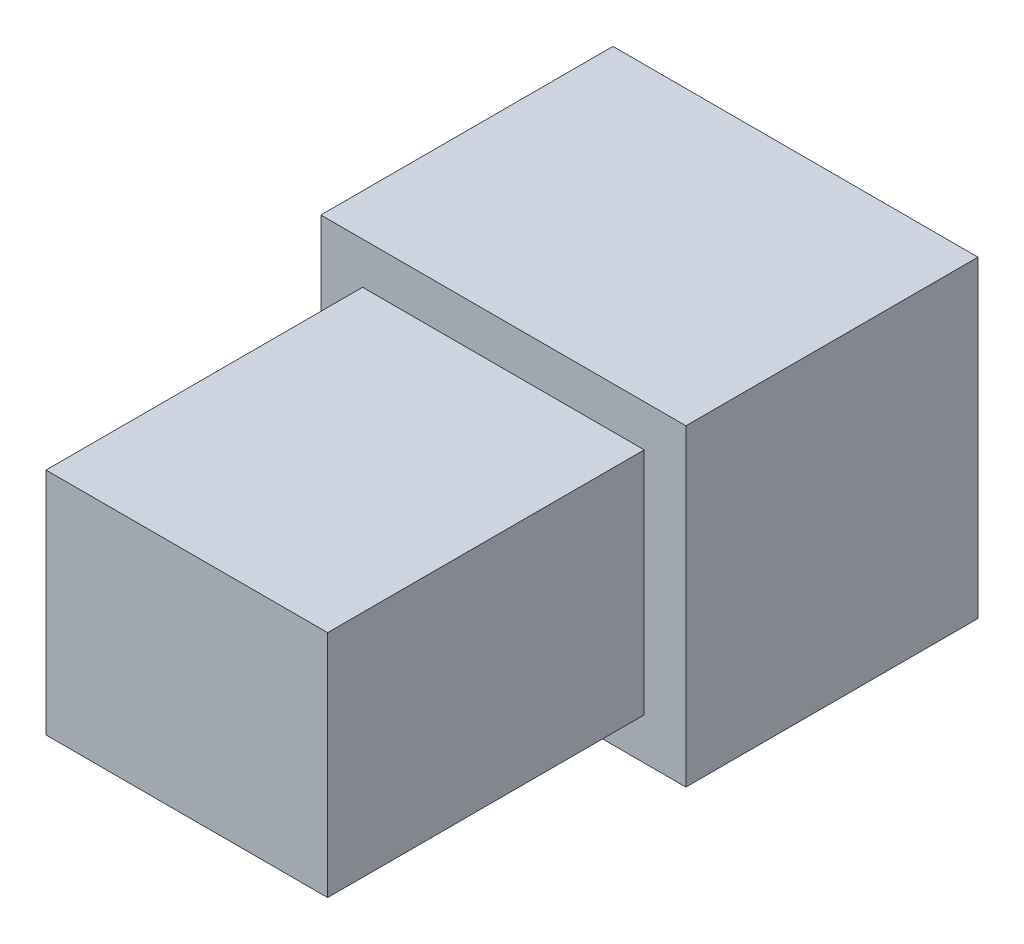
ISO-10303-21;
HEADER;
FILE_DESCRIPTION(('STEP AP214'),'2;1');
FILE_NAME('part.step','',(''),(''),'','','');
FILE_SCHEMA(('AUTOMOTIVE_DESIGN { 1 0 10303 214 1 1 1 1 }'));
ENDSEC;
DATA;
#1=APPLICATION_CONTEXT('core data for automotive mechanical design processes');
#2=APPLICATION_PROTOCOL_DEFINITION('international standard','automotive_design',2000,#1);
#3=PRODUCT_CONTEXT('',#1,'mechanical');
#4=PRODUCT('Part','Part','',(#3));
#5=PRODUCT_RELATED_PRODUCT_CATEGORY('part','',(#4));
#6=PRODUCT_DEFINITION_FORMATION('','',#4);
#7=PRODUCT_DEFINITION_CONTEXT('part definition',#1,'design');
#8=PRODUCT_DEFINITION('design','',#6,#7);
#9=PRODUCT_DEFINITION_SHAPE('','',#8);
#10=(LENGTH_UNIT() NAMED_UNIT(*) SI_UNIT(.MILLI.,.METRE.));
#11=(NAMED_UNIT(*) PLANE_ANGLE_UNIT() SI_UNIT($,.RADIAN.));
#12=(NAMED_UNIT(*) SI_UNIT($,.STERADIAN.) SOLID_ANGLE_UNIT());
#13=UNCERTAINTY_MEASURE_WITH_UNIT(LENGTH_MEASURE(1.E-05),#10,'distance_accuracy_value','');
#14=(GEOMETRIC_REPRESENTATION_CONTEXT(3) GLOBAL_UNCERTAINTY_ASSIGNED_CONTEXT((#13)) GLOBAL_UNIT_ASSIGNED_CONTEXT((#10,
#11,#12)) REPRESENTATION_CONTEXT('',''));
#15=CARTESIAN_POINT('',(0.,0.,0.));
#16=DIRECTION('',(0.,0.,1.));
#17=DIRECTION('',(1.,0.,0.));
#18=AXIS2_PLACEMENT_3D('',#15,#16,#17);
#19=CARTESIAN_POINT('',(4124.,1250.,2800.));
#20=DIRECTION('',(0.,0.,-1.));
#21=DIRECTION('',(-1.,0.,0.));
#22=AXIS2_PLACEMENT_3D('',#19,#20,#21);
#23=PLANE('',#22);
#24=DIRECTION('',(0.,-1.,0.));
#25=VECTOR('',#24,1.);
#26=CARTESIAN_POINT('',(4124.,-1750.,2800.));
#27=LINE('',#26,#25);
#28=CARTESIAN_POINT('',(4124.,1250.,2800.));
#29=VERTEX_POINT('',#28);
#30=CARTESIAN_POINT('',(4124.,-1750.,2800.));
#31=VERTEX_POINT('',#30);
#32=EDGE_CURVE('E125',#29,#31,#27,.T.);
#33=ORIENTED_EDGE('',*,*,#32,.T.);
#34=DIRECTION('',(1.,0.,0.));
#35=VECTOR('',#34,1.);
#36=CARTESIAN_POINT('',(4124.,-1750.,2800.));
#37=LINE('',#36,#35);
#38=CARTESIAN_POINT('',(7624.,-1750.,2800.));
#39=VERTEX_POINT('',#38);
#40=EDGE_CURVE('E128',#31,#39,#37,.T.);
#41=ORIENTED_EDGE('',*,*,#40,.T.);
#42=DIRECTION('',(0.,1.,0.));
#43=VECTOR('',#42,1.);
#44=CARTESIAN_POINT('',(7624.,-1750.,2800.));
#45=LINE('',#44,#43);
#46=CARTESIAN_POINT('',(7624.,1250.,2800.));
#47=VERTEX_POINT('',#46);
#48=EDGE_CURVE('E131',#39,#47,#45,.T.);
#49=ORIENTED_EDGE('',*,*,#48,.T.);
#50=DIRECTION('',(-1.,0.,0.));
#51=VECTOR('',#50,1.);
#52=CARTESIAN_POINT('',(4124.,1250.,2800.));
#53=LINE('',#52,#51);
#54=EDGE_CURVE('E133',#47,#29,#53,.T.);
#55=ORIENTED_EDGE('',*,*,#54,.T.);
#56=EDGE_LOOP('',(#33,#41,#49,#55));
#57=FACE_BOUND('',#56,.T.);
#58=DIRECTION('',(-1.,0.,0.));
#59=VECTOR('',#58,1.);
#60=CARTESIAN_POINT('',(7224.,850.000000000002,2800.));
#61=LINE('',#60,#59);
#62=CARTESIAN_POINT('',(7224.,850.000000000002,2800.));
#63=VERTEX_POINT('',#62);
#64=CARTESIAN_POINT('',(4524.,850.000000000002,2800.));
#65=VERTEX_POINT('',#64);
#66=EDGE_CURVE('E115',#63,#65,#61,.T.);
#67=ORIENTED_EDGE('',*,*,#66,.F.);
#68=DIRECTION('',(0.,1.,0.));
#69=VECTOR('',#68,1.);
#70=CARTESIAN_POINT('',(7224.,-1350.,2800.));
#71=LINE('',#70,#69);
#72=CARTESIAN_POINT('',(7224.,-1350.,2800.));
#73=VERTEX_POINT('',#72);
#74=EDGE_CURVE('E112',#73,#63,#71,.T.);
#75=ORIENTED_EDGE('',*,*,#74,.F.);
#76=DIRECTION('',(1.,0.,0.));
#77=VECTOR('',#76,1.);
#78=CARTESIAN_POINT('',(4524.,-1350.,2800.));
#79=LINE('',#78,#77);
#80=CARTESIAN_POINT('',(4524.,-1350.,2800.));
#81=VERTEX_POINT('',#80);
#82=EDGE_CURVE('E50',#81,#73,#79,.T.);
#83=ORIENTED_EDGE('',*,*,#82,.F.);
#84=DIRECTION('',(0.,-1.,0.));
#85=VECTOR('',#84,1.);
#86=CARTESIAN_POINT('',(4524.,850.000000000002,2800.));
#87=LINE('',#86,#85);
#88=EDGE_CURVE('E45',#65,#81,#87,.T.);
#89=ORIENTED_EDGE('',*,*,#88,.F.);
#90=EDGE_LOOP('',(#67,#75,#83,#89));
#91=FACE_BOUND('',#90,.T.);
#92=ADVANCED_FACE('F30',(#57,#91),#23,.F.);
#93=CARTESIAN_POINT('',(4124.,-1750.,2800.));
#94=DIRECTION('',(1.,0.,0.));
#95=DIRECTION('',(0.,1.,0.));
#96=AXIS2_PLACEMENT_3D('',#93,#94,#95);
#97=PLANE('',#96);
#98=DIRECTION('',(0.,-1.,0.));
#99=VECTOR('',#98,1.);
#100=CARTESIAN_POINT('',(4124.,-1750.,-1.16573417585641E-12));
#101=LINE('',#100,#99);
#102=CARTESIAN_POINT('',(4124.,1250.,8.11850586757146E-13));
#103=VERTEX_POINT('',#102);
#104=CARTESIAN_POINT('',(4124.,-1750.,-1.16573417585641E-12));
#105=VERTEX_POINT('',#104);
#106=EDGE_CURVE('E116',#103,#105,#101,.T.);
#107=ORIENTED_EDGE('',*,*,#106,.T.);
#108=DIRECTION('',(0.,0.,-1.));
#109=VECTOR('',#108,1.);
#110=CARTESIAN_POINT('',(4124.,-1750.,2800.));
#111=LINE('',#110,#109);
#112=EDGE_CURVE('E11',#31,#105,#111,.T.);
#113=ORIENTED_EDGE('',*,*,#112,.F.);
#114=ORIENTED_EDGE('',*,*,#32,.F.);
#115=DIRECTION('',(0.,0.,-1.));
#116=VECTOR('',#115,1.);
#117=CARTESIAN_POINT('',(4124.,1250.,2800.));
#118=LINE('',#117,#116);
#119=EDGE_CURVE('E134',#29,#103,#118,.T.);
#120=ORIENTED_EDGE('',*,*,#119,.T.);
#121=EDGE_LOOP('',(#107,#113,#114,#120));
#122=FACE_BOUND('',#121,.T.);
#123=ADVANCED_FACE('F32',(#122),#97,.F.);
#124=CARTESIAN_POINT('',(4124.,-1750.,2800.));
#125=DIRECTION('',(0.,1.,0.));
#126=DIRECTION('',(0.,0.,1.));
#127=AXIS2_PLACEMENT_3D('',#124,#125,#126);
#128=PLANE('',#127);
#129=DIRECTION('',(1.,0.,0.));
#130=VECTOR('',#129,1.);
#131=CARTESIAN_POINT('',(4124.,-1750.,-1.16573417585641E-12));
#132=LINE('',#131,#130);
#133=CARTESIAN_POINT('',(7624.,-1750.,-1.16573417585641E-12));
#134=VERTEX_POINT('',#133);
#135=EDGE_CURVE('E119',#105,#134,#132,.T.);
#136=ORIENTED_EDGE('',*,*,#135,.T.);
#137=DIRECTION('',(0.,0.,-1.));
#138=VECTOR('',#137,1.);
#139=CARTESIAN_POINT('',(7624.,-1750.,2800.));
#140=LINE('',#139,#138);
#141=EDGE_CURVE('E38',#39,#134,#140,.T.);
#142=ORIENTED_EDGE('',*,*,#141,.F.);
#143=ORIENTED_EDGE('',*,*,#40,.F.);
#144=ORIENTED_EDGE('',*,*,#112,.T.);
#145=EDGE_LOOP('',(#136,#142,#143,#144));
#146=FACE_BOUND('',#145,.T.);
#147=ADVANCED_FACE('F164',(#146),#128,.F.);
#148=CARTESIAN_POINT('',(7624.,-1750.,2800.));
#149=DIRECTION('',(-1.,0.,0.));
#150=DIRECTION('',(0.,0.,1.));
#151=AXIS2_PLACEMENT_3D('',#148,#149,#150);
#152=PLANE('',#151);
#153=DIRECTION('',(0.,1.,0.));
#154=VECTOR('',#153,1.);
#155=CARTESIAN_POINT('',(7624.,-1750.,-1.16573417585641E-12));
#156=LINE('',#155,#154);
#157=CARTESIAN_POINT('',(7624.,1250.,8.11850586757146E-13));
#158=VERTEX_POINT('',#157);
#159=EDGE_CURVE('E137',#134,#158,#156,.T.);
#160=ORIENTED_EDGE('',*,*,#159,.T.);
#161=DIRECTION('',(0.,0.,-1.));
#162=VECTOR('',#161,1.);
#163=CARTESIAN_POINT('',(7624.,1250.,2800.));
#164=LINE('',#163,#162);
#165=EDGE_CURVE('E142',#47,#158,#164,.T.);
#166=ORIENTED_EDGE('',*,*,#165,.F.);
#167=ORIENTED_EDGE('',*,*,#48,.F.);
#168=ORIENTED_EDGE('',*,*,#141,.T.);
#169=EDGE_LOOP('',(#160,#166,#167,#168));
#170=FACE_BOUND('',#169,.T.);
#171=ADVANCED_FACE('F149',(#170),#152,.F.);
#172=CARTESIAN_POINT('',(4124.,1250.,2800.));
#173=DIRECTION('',(0.,-1.,0.));
#174=DIRECTION('',(0.,0.,-1.));
#175=AXIS2_PLACEMENT_3D('',#172,#173,#174);
#176=PLANE('',#175);
#177=DIRECTION('',(-1.,0.,0.));
#178=VECTOR('',#177,1.);
#179=CARTESIAN_POINT('',(4124.,1250.,8.11850586757146E-13));
#180=LINE('',#179,#178);
#181=EDGE_CURVE('E129',#158,#103,#180,.T.);
#182=ORIENTED_EDGE('',*,*,#181,.T.);
#183=ORIENTED_EDGE('',*,*,#119,.F.);
#184=ORIENTED_EDGE('',*,*,#54,.F.);
#185=ORIENTED_EDGE('',*,*,#165,.T.);
#186=EDGE_LOOP('',(#182,#183,#184,#185));
#187=FACE_BOUND('',#186,.T.);
#188=ADVANCED_FACE('F158',(#187),#176,.F.);
#189=CARTESIAN_POINT('',(4124.,1250.,8.11850586757146E-13));
#190=DIRECTION('',(0.,0.,-1.));
#191=DIRECTION('',(-1.,0.,0.));
#192=AXIS2_PLACEMENT_3D('',#189,#190,#191);
#193=PLANE('',#192);
#194=ORIENTED_EDGE('',*,*,#106,.F.);
#195=ORIENTED_EDGE('',*,*,#181,.F.);
#196=ORIENTED_EDGE('',*,*,#159,.F.);
#197=ORIENTED_EDGE('',*,*,#135,.F.);
#198=EDGE_LOOP('',(#194,#195,#196,#197));
#199=FACE_BOUND('',#198,.T.);
#200=ADVANCED_FACE('F155',(#199),#193,.T.);
#201=CARTESIAN_POINT('',(7224.,850.000000000004,5835.));
#202=DIRECTION('',(0.,-1.,0.));
#203=DIRECTION('',(0.,0.,-1.));
#204=AXIS2_PLACEMENT_3D('',#201,#202,#203);
#205=PLANE('',#204);
#206=ORIENTED_EDGE('',*,*,#66,.T.);
#207=DIRECTION('',(0.,0.,-1.));
#208=VECTOR('',#207,1.);
#209=CARTESIAN_POINT('',(4524.,850.000000000004,5835.));
#210=LINE('',#209,#208);
#211=CARTESIAN_POINT('',(4524.,850.000000000004,5835.));
#212=VERTEX_POINT('',#211);
#213=EDGE_CURVE('E96',#212,#65,#210,.T.);
#214=ORIENTED_EDGE('',*,*,#213,.F.);
#215=DIRECTION('',(-1.,0.,0.));
#216=VECTOR('',#215,1.);
#217=CARTESIAN_POINT('',(7224.,850.000000000004,5835.));
#218=LINE('',#217,#216);
#219=CARTESIAN_POINT('',(7224.,850.000000000004,5835.));
#220=VERTEX_POINT('',#219);
#221=EDGE_CURVE('E103',#220,#212,#218,.T.);
#222=ORIENTED_EDGE('',*,*,#221,.F.);
#223=DIRECTION('',(0.,0.,-1.));
#224=VECTOR('',#223,1.);
#225=CARTESIAN_POINT('',(7224.,850.000000000004,5835.));
#226=LINE('',#225,#224);
#227=EDGE_CURVE('E225',#220,#63,#226,.T.);
#228=ORIENTED_EDGE('',*,*,#227,.T.);
#229=EDGE_LOOP('',(#206,#214,#222,#228));
#230=FACE_BOUND('',#229,.T.);
#231=ADVANCED_FACE('F114',(#230),#205,.F.);
#232=CARTESIAN_POINT('',(4524.,850.000000000004,5835.));
#233=DIRECTION('',(1.,0.,0.));
#234=DIRECTION('',(0.,1.,0.));
#235=AXIS2_PLACEMENT_3D('',#232,#233,#234);
#236=PLANE('',#235);
#237=ORIENTED_EDGE('',*,*,#88,.T.);
#238=DIRECTION('',(0.,0.,-1.));
#239=VECTOR('',#238,1.);
#240=CARTESIAN_POINT('',(4524.,-1350.,5835.));
#241=LINE('',#240,#239);
#242=CARTESIAN_POINT('',(4524.,-1350.,5835.));
#243=VERTEX_POINT('',#242);
#244=EDGE_CURVE('E99',#243,#81,#241,.T.);
#245=ORIENTED_EDGE('',*,*,#244,.F.);
#246=DIRECTION('',(0.,-1.,0.));
#247=VECTOR('',#246,1.);
#248=CARTESIAN_POINT('',(4524.,850.000000000004,5835.));
#249=LINE('',#248,#247);
#250=EDGE_CURVE('E92',#212,#243,#249,.T.);
#251=ORIENTED_EDGE('',*,*,#250,.F.);
#252=ORIENTED_EDGE('',*,*,#213,.T.);
#253=EDGE_LOOP('',(#237,#245,#251,#252));
#254=FACE_BOUND('',#253,.T.);
#255=ADVANCED_FACE('F94',(#254),#236,.F.);
#256=CARTESIAN_POINT('',(4524.,-1350.,5835.));
#257=DIRECTION('',(0.,1.,0.));
#258=DIRECTION('',(0.,0.,1.));
#259=AXIS2_PLACEMENT_3D('',#256,#257,#258);
#260=PLANE('',#259);
#261=ORIENTED_EDGE('',*,*,#82,.T.);
#262=DIRECTION('',(0.,0.,-1.));
#263=VECTOR('',#262,1.);
#264=CARTESIAN_POINT('',(7224.,-1350.,5835.));
#265=LINE('',#264,#263);
#266=CARTESIAN_POINT('',(7224.,-1350.,5835.));
#267=VERTEX_POINT('',#266);
#268=EDGE_CURVE('E121',#267,#73,#265,.T.);
#269=ORIENTED_EDGE('',*,*,#268,.F.);
#270=DIRECTION('',(1.,0.,0.));
#271=VECTOR('',#270,1.);
#272=CARTESIAN_POINT('',(4524.,-1350.,5835.));
#273=LINE('',#272,#271);
#274=EDGE_CURVE('E102',#243,#267,#273,.T.);
#275=ORIENTED_EDGE('',*,*,#274,.F.);
#276=ORIENTED_EDGE('',*,*,#244,.T.);
#277=EDGE_LOOP('',(#261,#269,#275,#276));
#278=FACE_BOUND('',#277,.T.);
#279=ADVANCED_FACE('F200',(#278),#260,.F.);
#280=CARTESIAN_POINT('',(7224.,-1350.,5835.));
#281=DIRECTION('',(-1.,0.,0.));
#282=DIRECTION('',(0.,0.,1.));
#283=AXIS2_PLACEMENT_3D('',#280,#281,#282);
#284=PLANE('',#283);
#285=ORIENTED_EDGE('',*,*,#74,.T.);
#286=ORIENTED_EDGE('',*,*,#227,.F.);
#287=DIRECTION('',(0.,1.,0.));
#288=VECTOR('',#287,1.);
#289=CARTESIAN_POINT('',(7224.,-1350.,5835.));
#290=LINE('',#289,#288);
#291=EDGE_CURVE('E108',#267,#220,#290,.T.);
#292=ORIENTED_EDGE('',*,*,#291,.F.);
#293=ORIENTED_EDGE('',*,*,#268,.T.);
#294=EDGE_LOOP('',(#285,#286,#292,#293));
#295=FACE_BOUND('',#294,.T.);
#296=ADVANCED_FACE('F206',(#295),#284,.F.);
#297=CARTESIAN_POINT('',(4524.,850.000000000004,5835.));
#298=DIRECTION('',(0.,0.,1.));
#299=DIRECTION('',(1.,0.,0.));
#300=AXIS2_PLACEMENT_3D('',#297,#298,#299);
#301=PLANE('',#300);
#302=ORIENTED_EDGE('',*,*,#221,.T.);
#303=ORIENTED_EDGE('',*,*,#250,.T.);
#304=ORIENTED_EDGE('',*,*,#274,.T.);
#305=ORIENTED_EDGE('',*,*,#291,.T.);
#306=EDGE_LOOP('',(#302,#303,#304,#305));
#307=FACE_BOUND('',#306,.T.);
#308=ADVANCED_FACE('F106',(#307),#301,.T.);
#309=CLOSED_SHELL('',(#92,#123,#147,#171,#188,#200,#231,#255,#279,#296,#308));
#310=MANIFOLD_SOLID_BREP('B2',#309);
#311=ADVANCED_BREP_SHAPE_REPRESENTATION('',(#18,#310),#14);
#312=SHAPE_DEFINITION_REPRESENTATION(#9,#311);
ENDSEC;
END-ISO-10303-21;
